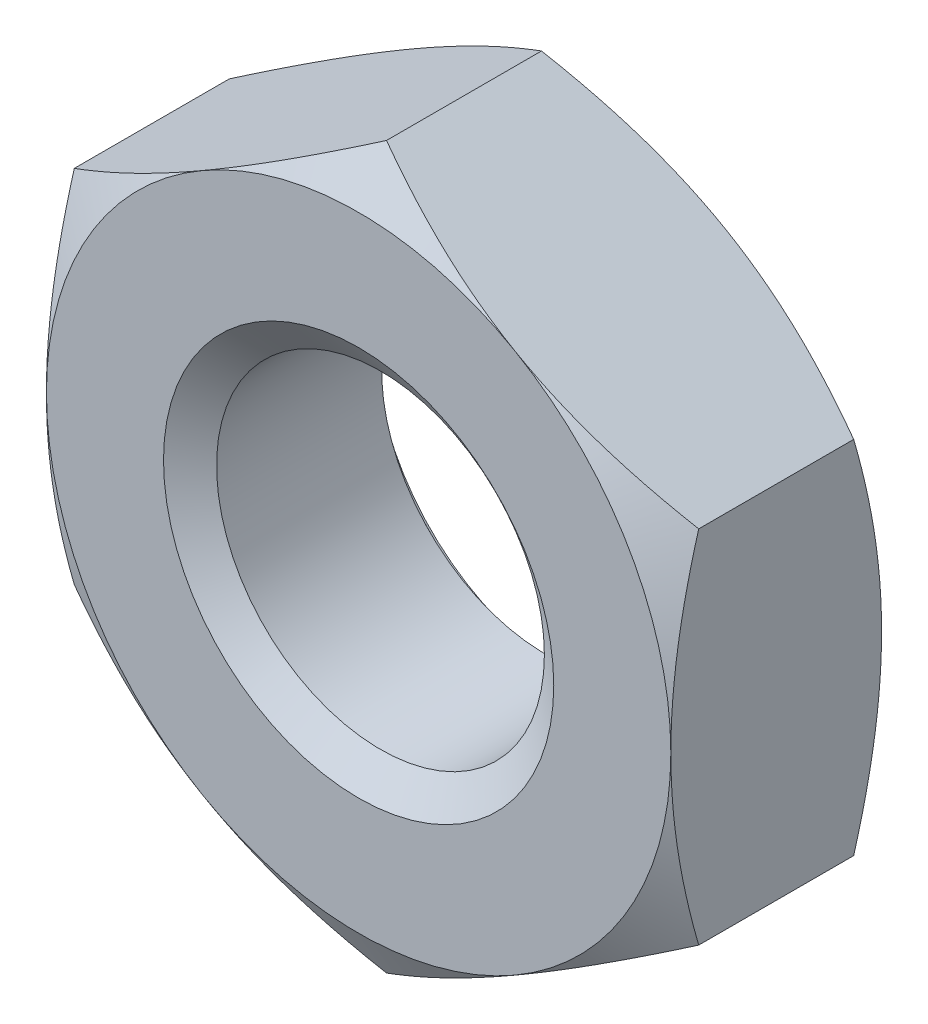
ISO-10303-21;
HEADER;
FILE_DESCRIPTION(('STEP AP214'),'2;1');
FILE_NAME('part.step','',(''),(''),'','','');
FILE_SCHEMA(('AUTOMOTIVE_DESIGN { 1 0 10303 214 1 1 1 1 }'));
ENDSEC;
DATA;
#1=APPLICATION_CONTEXT('core data for automotive mechanical design processes');
#2=APPLICATION_PROTOCOL_DEFINITION('international standard','automotive_design',2000,#1);
#3=PRODUCT_CONTEXT('',#1,'mechanical');
#4=PRODUCT('Part','Part','',(#3));
#5=PRODUCT_RELATED_PRODUCT_CATEGORY('part','',(#4));
#6=PRODUCT_DEFINITION_FORMATION('','',#4);
#7=PRODUCT_DEFINITION_CONTEXT('part definition',#1,'design');
#8=PRODUCT_DEFINITION('design','',#6,#7);
#9=PRODUCT_DEFINITION_SHAPE('','',#8);
#10=(LENGTH_UNIT() NAMED_UNIT(*) SI_UNIT(.MILLI.,.METRE.));
#11=(NAMED_UNIT(*) PLANE_ANGLE_UNIT() SI_UNIT($,.RADIAN.));
#12=(NAMED_UNIT(*) SI_UNIT($,.STERADIAN.) SOLID_ANGLE_UNIT());
#13=UNCERTAINTY_MEASURE_WITH_UNIT(LENGTH_MEASURE(1.E-05),#10,'distance_accuracy_value','');
#14=(GEOMETRIC_REPRESENTATION_CONTEXT(3) GLOBAL_UNCERTAINTY_ASSIGNED_CONTEXT((#13)) GLOBAL_UNIT_ASSIGNED_CONTEXT((#10,
#11,#12)) REPRESENTATION_CONTEXT('',''));
#15=CARTESIAN_POINT('',(0.,0.,0.));
#16=DIRECTION('',(0.,0.,1.));
#17=DIRECTION('',(1.,0.,0.));
#18=AXIS2_PLACEMENT_3D('',#15,#16,#17);
#19=CARTESIAN_POINT('',(0.,0.,-2.7));
#20=DIRECTION('',(0.,0.,1.));
#21=DIRECTION('',(1.,0.,0.));
#22=AXIS2_PLACEMENT_3D('',#19,#20,#21);
#23=CYLINDRICAL_SURFACE('',#22,2.1);
#24=CARTESIAN_POINT('',(0.,0.,-0.280083015283874));
#25=DIRECTION('',(0.,0.,1.));
#26=DIRECTION('',(1.,0.,0.));
#27=AXIS2_PLACEMENT_3D('',#24,#25,#26);
#28=CIRCLE('',#27,2.1);
#29=CARTESIAN_POINT('',(2.1,0.,-0.280083015283874));
#30=VERTEX_POINT('',#29);
#31=EDGE_CURVE('E174',#30,#30,#28,.F.);
#32=CARTESIAN_POINT('',(0.,0.,-2.39451698471611));
#33=DIRECTION('',(0.,0.,-1.));
#34=DIRECTION('',(-1.,0.,0.));
#35=AXIS2_PLACEMENT_3D('',#32,#33,#34);
#36=CIRCLE('',#35,2.1);
#37=CARTESIAN_POINT('',(2.1,0.,-2.39451698471611));
#38=VERTEX_POINT('',#37);
#39=EDGE_CURVE('E39',#38,#38,#36,.F.);
#40=CARTESIAN_POINT('',(2.1,0.,-0.280083015283874));
#41=CARTESIAN_POINT('',(2.1,0.,-0.302108369132126));
#42=CARTESIAN_POINT('',(2.1,0.,-0.324133722980379));
#43=CARTESIAN_POINT('',(2.1,0.,-0.368184430676884));
#44=CARTESIAN_POINT('',(2.1,0.,-0.390209784525137));
#45=CARTESIAN_POINT('',(2.1,0.,-0.434260492221642));
#46=CARTESIAN_POINT('',(2.1,0.,-0.456285846069894));
#47=CARTESIAN_POINT('',(2.1,0.,-0.500336553766399));
#48=CARTESIAN_POINT('',(2.1,0.,-0.522361907614652));
#49=CARTESIAN_POINT('',(2.1,0.,-0.566412615311157));
#50=CARTESIAN_POINT('',(2.1,0.,-0.588437969159409));
#51=CARTESIAN_POINT('',(2.1,0.,-0.632488676855914));
#52=CARTESIAN_POINT('',(2.1,0.,-0.654514030704167));
#53=CARTESIAN_POINT('',(2.1,0.,-0.698564738400672));
#54=CARTESIAN_POINT('',(2.1,0.,-0.720590092248924));
#55=CARTESIAN_POINT('',(2.1,0.,-0.764640799945429));
#56=CARTESIAN_POINT('',(2.1,0.,-0.786666153793681));
#57=CARTESIAN_POINT('',(2.1,0.,-0.830716861490186));
#58=CARTESIAN_POINT('',(2.1,0.,-0.852742215338439));
#59=CARTESIAN_POINT('',(2.1,0.,-0.896792923034944));
#60=CARTESIAN_POINT('',(2.1,0.,-0.918818276883196));
#61=CARTESIAN_POINT('',(2.1,0.,-0.962868984579701));
#62=CARTESIAN_POINT('',(2.1,0.,-0.984894338427954));
#63=CARTESIAN_POINT('',(2.1,0.,-1.02894504612446));
#64=CARTESIAN_POINT('',(2.1,0.,-1.05097039997271));
#65=CARTESIAN_POINT('',(2.1,0.,-1.09502110766922));
#66=CARTESIAN_POINT('',(2.1,0.,-1.11704646151747));
#67=CARTESIAN_POINT('',(2.1,0.,-1.16109716921397));
#68=CARTESIAN_POINT('',(2.1,0.,-1.18312252306223));
#69=CARTESIAN_POINT('',(2.1,0.,-1.22717323075873));
#70=CARTESIAN_POINT('',(2.1,0.,-1.24919858460698));
#71=CARTESIAN_POINT('',(2.1,0.,-1.29324929230349));
#72=CARTESIAN_POINT('',(2.1,0.,-1.31527464615174));
#73=CARTESIAN_POINT('',(2.1,0.,-1.35932535384825));
#74=CARTESIAN_POINT('',(2.1,0.,-1.3813507076965));
#75=CARTESIAN_POINT('',(2.1,0.,-1.425401415393));
#76=CARTESIAN_POINT('',(2.1,0.,-1.44742676924126));
#77=CARTESIAN_POINT('',(2.1,0.,-1.49147747693776));
#78=CARTESIAN_POINT('',(2.1,0.,-1.51350283078601));
#79=CARTESIAN_POINT('',(2.1,0.,-1.55755353848252));
#80=CARTESIAN_POINT('',(2.1,0.,-1.57957889233077));
#81=CARTESIAN_POINT('',(2.1,0.,-1.62362960002728));
#82=CARTESIAN_POINT('',(2.1,0.,-1.64565495387553));
#83=CARTESIAN_POINT('',(2.1,0.,-1.68970566157203));
#84=CARTESIAN_POINT('',(2.1,0.,-1.71173101542029));
#85=CARTESIAN_POINT('',(2.1,0.,-1.75578172311679));
#86=CARTESIAN_POINT('',(2.1,0.,-1.77780707696504));
#87=CARTESIAN_POINT('',(2.1,0.,-1.82185778466155));
#88=CARTESIAN_POINT('',(2.1,0.,-1.8438831385098));
#89=CARTESIAN_POINT('',(2.1,0.,-1.88793384620631));
#90=CARTESIAN_POINT('',(2.1,0.,-1.90995920005456));
#91=CARTESIAN_POINT('',(2.1,0.,-1.95400990775106));
#92=CARTESIAN_POINT('',(2.1,0.,-1.97603526159932));
#93=CARTESIAN_POINT('',(2.1,0.,-2.02008596929582));
#94=CARTESIAN_POINT('',(2.1,0.,-2.04211132314407));
#95=CARTESIAN_POINT('',(2.1,0.,-2.08616203084058));
#96=CARTESIAN_POINT('',(2.1,0.,-2.10818738468883));
#97=CARTESIAN_POINT('',(2.1,0.,-2.15223809238534));
#98=CARTESIAN_POINT('',(2.1,0.,-2.17426344623359));
#99=CARTESIAN_POINT('',(2.1,0.,-2.21831415393009));
#100=CARTESIAN_POINT('',(2.1,0.,-2.24033950777835));
#101=CARTESIAN_POINT('',(2.1,0.,-2.28439021547485));
#102=CARTESIAN_POINT('',(2.1,0.,-2.3064155693231));
#103=CARTESIAN_POINT('',(2.1,0.,-2.35046627701961));
#104=CARTESIAN_POINT('',(2.1,0.,-2.37249163086786));
#105=CARTESIAN_POINT('',(2.1,0.,-2.39451698471611));
#106=B_SPLINE_CURVE_WITH_KNOTS('',3,(#40,#41,#42,#43,#44,#45,#46,#47,#48,#49,#50,#51,#52,#53,
#54,#55,#56,#57,#58,#59,#60,#61,#62,#63,#64,#65,#66,#67,#68,#69,#70,#71,#72,#73,#74,#75,#76,#77,
#78,#79,#80,#81,#82,#83,#84,#85,#86,#87,#88,#89,#90,#91,#92,#93,#94,#95,#96,#97,#98,#99,#100,
#101,#102,#103,#104,#105),.UNSPECIFIED.,.F.,.F.,(4,2,2,2,2,2,2,2,2,2,2,2,2,2,2,2,2,2,2,2,2,2,2,
2,2,2,2,2,2,2,2,2,4),(0.,0.0660760615447576,0.132152123089515,0.198228184634273,
0.26430424617903,0.330380307723787,0.396456369268545,0.462532430813302,0.52860849235806,
0.594684553902817,0.660760615447575,0.726836676992332,0.79291273853709,0.858988800081848,
0.925064861626605,0.991140923171362,1.05721698471612,1.12329304626088,1.18936910780564,
1.25544516935039,1.32152123089515,1.38759729243991,1.45367335398466,1.51974941552942,
1.58582547707418,1.65190153861894,1.7179776001637,1.78405366170845,1.85012972325321,
1.91620578479797,1.98228184634272,2.04835790788748,2.11443396943224),.UNSPECIFIED.);
#107=EDGE_CURVE('BSEAM34',#30,#38,#106,.T.);
#108=ORIENTED_EDGE('',*,*,#31,.F.);
#109=ORIENTED_EDGE('',*,*,#39,.F.);
#110=ORIENTED_EDGE('',*,*,#107,.T.);
#111=ORIENTED_EDGE('',*,*,#107,.F.);
#112=EDGE_LOOP('',(#108,#110,#109,#111));
#113=FACE_BOUND('',#112,.T.);
#114=ADVANCED_FACE('F34',(#113),#23,.F.);
#115=CARTESIAN_POINT('',(0.,4.61880215351703,-2.7));
#116=DIRECTION('',(-0.500000000000007,0.866025403784434,0.));
#117=DIRECTION('',(-0.866025403784435,-0.500000000000007,0.));
#118=AXIS2_PLACEMENT_3D('',#115,#116,#117);
#119=PLANE('',#118);
#120=DIRECTION('',(0.,0.,1.));
#121=VECTOR('',#120,1.);
#122=CARTESIAN_POINT('',(-4.,2.30940107675848,-2.7));
#123=LINE('',#122,#121);
#124=CARTESIAN_POINT('',(-4.,2.30940107675855,-2.34273441009182));
#125=VERTEX_POINT('',#124);
#126=CARTESIAN_POINT('',(-4.,2.30940107675848,-0.357265589908158));
#127=VERTEX_POINT('',#126);
#128=EDGE_CURVE('E164',#125,#127,#123,.T.);
#129=ORIENTED_EDGE('',*,*,#128,.T.);
#130=CARTESIAN_POINT('',(-4.0002,2.30928560670464,-0.357332259074762));
#131=CARTESIAN_POINT('',(-3.82442084967677,2.41077174646168,-0.298717873648278));
#132=CARTESIAN_POINT('',(-3.64712438367362,2.51313390883497,-0.245410321462258));
#133=CARTESIAN_POINT('',(-3.2894614068243,2.7196307247981,-0.1523616707464));
#134=CARTESIAN_POINT('',(-3.10908854102985,2.82376904741903,-0.112653489029701));
#135=CARTESIAN_POINT('',(-2.75057818129722,3.03075510011794,-0.0508422152802766));
#136=CARTESIAN_POINT('',(-2.57249584706487,3.1335709837249,-0.0283277315228868));
#137=CARTESIAN_POINT('',(-2.2154932828335,3.33968651028527,-0.00145062314658075));
#138=CARTESIAN_POINT('',(-2.03657435035591,3.44298540411433,0.00293425857305725));
#139=CARTESIAN_POINT('',(-1.70225715780328,3.63600352522932,-0.00619007293997113));
#140=CARTESIAN_POINT('',(-1.54680884001294,3.72575165335065,-0.0174589539879961));
#141=CARTESIAN_POINT('',(-1.23692494436495,3.90466320392055,-0.0531739907981968));
#142=CARTESIAN_POINT('',(-1.08249043825588,3.99382600759479,-0.0776323457115377));
#143=CARTESIAN_POINT('',(-0.771967672225425,4.17310641015198,-0.138776064919297));
#144=CARTESIAN_POINT('',(-0.615918711936899,4.26320131938133,-0.175720603654872));
#145=CARTESIAN_POINT('',(-0.306148164596159,4.44204742827552,-0.259570072548039));
#146=CARTESIAN_POINT('',(-0.152422609226218,4.53080091904968,-0.306455302212754));
#147=CARTESIAN_POINT('',(0.000200000000004147,4.61891762357087,-0.357332259074783));
#148=B_SPLINE_CURVE_WITH_KNOTS('',3,(#130,#131,#132,#133,#134,#135,#136,#137,#138,#139,#140,
#141,#142,#143,#144,#145,#146,#147),.UNSPECIFIED.,.F.,.F.,(4,2,2,2,2,2,2,2,4),(0.,
0.634047835695964,1.26961969224543,1.88946157213122,2.50854226669297,3.04757825393386,
3.58711366126905,4.13861653143766,4.68903648037746),.UNSPECIFIED.);
#149=CARTESIAN_POINT('',(-2.00000000000003,3.46410161513774,0.));
#150=VERTEX_POINT('',#149);
#151=EDGE_CURVE('E133',#127,#150,#148,.T.);
#152=ORIENTED_EDGE('',*,*,#151,.T.);
#153=CARTESIAN_POINT('',(0.,4.61880215351703,-0.357265589908179));
#154=VERTEX_POINT('',#153);
#155=EDGE_CURVE('E53',#150,#154,#148,.T.);
#156=ORIENTED_EDGE('',*,*,#155,.T.);
#157=DIRECTION('',(0.,0.,1.));
#158=VECTOR('',#157,1.);
#159=CARTESIAN_POINT('',(0.,4.61880215351703,-2.7));
#160=LINE('',#159,#158);
#161=CARTESIAN_POINT('',(0.,4.61880215351703,-2.34273441009182));
#162=VERTEX_POINT('',#161);
#163=EDGE_CURVE('E149',#162,#154,#160,.T.);
#164=ORIENTED_EDGE('',*,*,#163,.F.);
#165=CARTESIAN_POINT('',(-4.0002,2.30928560670464,-2.34266774092524));
#166=CARTESIAN_POINT('',(-3.82442084967677,2.41077174646168,-2.40128212635172));
#167=CARTESIAN_POINT('',(-3.64712438367362,2.51313390883497,-2.45458967853774));
#168=CARTESIAN_POINT('',(-3.2894614068243,2.7196307247981,-2.5476383292536));
#169=CARTESIAN_POINT('',(-3.10908854102985,2.82376904741903,-2.5873465109703));
#170=CARTESIAN_POINT('',(-2.75057818129722,3.03075510011794,-2.64915778471972));
#171=CARTESIAN_POINT('',(-2.57249584706487,3.1335709837249,-2.67167226847711));
#172=CARTESIAN_POINT('',(-2.2154932828335,3.33968651028527,-2.69854937685342));
#173=CARTESIAN_POINT('',(-2.03657435035591,3.44298540411433,-2.70293425857306));
#174=CARTESIAN_POINT('',(-1.70225715780328,3.63600352522932,-2.69380992706003));
#175=CARTESIAN_POINT('',(-1.54680884001294,3.72575165335065,-2.682541046012));
#176=CARTESIAN_POINT('',(-1.23692494436495,3.90466320392055,-2.6468260092018));
#177=CARTESIAN_POINT('',(-1.08249043825588,3.99382600759479,-2.62236765428846));
#178=CARTESIAN_POINT('',(-0.771967672225424,4.17310641015198,-2.5612239350807));
#179=CARTESIAN_POINT('',(-0.615918711936899,4.26320131938133,-2.52427939634513));
#180=CARTESIAN_POINT('',(-0.306148164596159,4.44204742827552,-2.44042992745196));
#181=CARTESIAN_POINT('',(-0.152422609226218,4.53080091904969,-2.39354469778725));
#182=CARTESIAN_POINT('',(0.000200000000004149,4.61891762357087,-2.34266774092522));
#183=B_SPLINE_CURVE_WITH_KNOTS('',3,(#165,#166,#167,#168,#169,#170,#171,#172,#173,#174,#175,
#176,#177,#178,#179,#180,#181,#182),.UNSPECIFIED.,.F.,.F.,(4,2,2,2,2,2,2,2,4),(0.,
0.634047835695964,1.26961969224543,1.88946157213122,2.50854226669297,3.04757825393386,
3.58711366126905,4.13861653143766,4.68903648037746),.UNSPECIFIED.);
#184=CARTESIAN_POINT('',(-2.00000000000003,3.46410161513774,-2.7));
#185=VERTEX_POINT('',#184);
#186=EDGE_CURVE('E167',#185,#162,#183,.T.);
#187=ORIENTED_EDGE('',*,*,#186,.F.);
#188=EDGE_CURVE('E266',#125,#185,#183,.T.);
#189=ORIENTED_EDGE('',*,*,#188,.F.);
#190=EDGE_LOOP('',(#129,#152,#156,#164,#187,#189));
#191=FACE_BOUND('',#190,.T.);
#192=ADVANCED_FACE('F36',(#191),#119,.T.);
#193=CARTESIAN_POINT('',(4.,2.30940107675847,-2.7));
#194=DIRECTION('',(0.500000000000009,0.866025403784433,0.));
#195=DIRECTION('',(-0.866025403784433,0.500000000000009,0.));
#196=AXIS2_PLACEMENT_3D('',#193,#194,#195);
#197=PLANE('',#196);
#198=ORIENTED_EDGE('',*,*,#163,.T.);
#199=CARTESIAN_POINT('',(-0.000199999999995798,4.61891762357087,-0.357332259074783));
#200=CARTESIAN_POINT('',(0.175579150323232,4.51743148381383,-0.298717873648296));
#201=CARTESIAN_POINT('',(0.352875616326384,4.41506932144053,-0.245410321462275));
#202=CARTESIAN_POINT('',(0.71053859317571,4.20857250547741,-0.152361670746413));
#203=CARTESIAN_POINT('',(0.890911458970154,4.10443418285648,-0.112653489029712));
#204=CARTESIAN_POINT('',(1.24942181870279,3.89744813015757,-0.0508422152802835));
#205=CARTESIAN_POINT('',(1.42750415293515,3.7946322465506,-0.0283277315228917));
#206=CARTESIAN_POINT('',(1.78450671716651,3.58851671999023,-0.00145062314658183));
#207=CARTESIAN_POINT('',(1.9634256496441,3.48521782616117,0.00293425857305806));
#208=CARTESIAN_POINT('',(2.29774284219673,3.29219970504618,-0.00619007293996718));
#209=CARTESIAN_POINT('',(2.45319115998707,3.20245157692485,-0.0174589539879905));
#210=CARTESIAN_POINT('',(2.76307505563506,3.02354002635495,-0.0531739907981881));
#211=CARTESIAN_POINT('',(2.91750956174413,2.93437722268071,-0.0776323457115274));
#212=CARTESIAN_POINT('',(3.22803232777458,2.75509682012352,-0.138776064919283));
#213=CARTESIAN_POINT('',(3.3840812880631,2.66500191089418,-0.175720603654856));
#214=CARTESIAN_POINT('',(3.69385183540384,2.48615580199998,-0.25957007254802));
#215=CARTESIAN_POINT('',(3.84757739077378,2.39740231122582,-0.306455302212732));
#216=CARTESIAN_POINT('',(4.0002,2.30928560670464,-0.35733225907476));
#217=B_SPLINE_CURVE_WITH_KNOTS('',3,(#199,#200,#201,#202,#203,#204,#205,#206,#207,#208,#209,
#210,#211,#212,#213,#214,#215,#216),.UNSPECIFIED.,.F.,.F.,(4,2,2,2,2,2,2,2,4),(0.,
0.63404783569597,1.26961969224544,1.88946157213123,2.50854226669299,3.04757825393387,
3.58711366126905,4.13861653143766,4.68903648037746),.UNSPECIFIED.);
#218=CARTESIAN_POINT('',(2.00000000000004,3.46410161513773,0.));
#219=VERTEX_POINT('',#218);
#220=EDGE_CURVE('E143',#154,#219,#217,.T.);
#221=ORIENTED_EDGE('',*,*,#220,.T.);
#222=CARTESIAN_POINT('',(4.,2.30940107675855,-0.357265589908179));
#223=VERTEX_POINT('',#222);
#224=EDGE_CURVE('E60',#219,#223,#217,.T.);
#225=ORIENTED_EDGE('',*,*,#224,.T.);
#226=DIRECTION('',(0.,0.,1.));
#227=VECTOR('',#226,1.);
#228=CARTESIAN_POINT('',(4.,2.30940107675847,-2.7));
#229=LINE('',#228,#227);
#230=CARTESIAN_POINT('',(4.,2.30940107675855,-2.34273441009182));
#231=VERTEX_POINT('',#230);
#232=EDGE_CURVE('E142',#231,#223,#229,.T.);
#233=ORIENTED_EDGE('',*,*,#232,.F.);
#234=CARTESIAN_POINT('',(-0.000199999999996007,4.61891762357087,-2.34266774092522));
#235=CARTESIAN_POINT('',(0.175579150323232,4.51743148381383,-2.4012821263517));
#236=CARTESIAN_POINT('',(0.352875616326384,4.41506932144053,-2.45458967853773));
#237=CARTESIAN_POINT('',(0.71053859317571,4.20857250547741,-2.54763832925359));
#238=CARTESIAN_POINT('',(0.890911458970154,4.10443418285648,-2.58734651097029));
#239=CARTESIAN_POINT('',(1.24942181870279,3.89744813015757,-2.64915778471972));
#240=CARTESIAN_POINT('',(1.42750415293514,3.7946322465506,-2.67167226847711));
#241=CARTESIAN_POINT('',(1.78450671716651,3.58851671999023,-2.69854937685342));
#242=CARTESIAN_POINT('',(1.9634256496441,3.48521782616117,-2.70293425857306));
#243=CARTESIAN_POINT('',(2.29774284219673,3.29219970504618,-2.69380992706003));
#244=CARTESIAN_POINT('',(2.45319115998707,3.20245157692485,-2.68254104601201));
#245=CARTESIAN_POINT('',(2.76307505563506,3.02354002635495,-2.64682600920181));
#246=CARTESIAN_POINT('',(2.91750956174413,2.93437722268071,-2.62236765428847));
#247=CARTESIAN_POINT('',(3.22803232777458,2.75509682012352,-2.56122393508072));
#248=CARTESIAN_POINT('',(3.3840812880631,2.66500191089418,-2.52427939634514));
#249=CARTESIAN_POINT('',(3.69385183540384,2.48615580199998,-2.44042992745198));
#250=CARTESIAN_POINT('',(3.84757739077378,2.39740231122582,-2.39354469778727));
#251=CARTESIAN_POINT('',(4.0002,2.30928560670464,-2.34266774092524));
#252=B_SPLINE_CURVE_WITH_KNOTS('',3,(#234,#235,#236,#237,#238,#239,#240,#241,#242,#243,#244,
#245,#246,#247,#248,#249,#250,#251),.UNSPECIFIED.,.F.,.F.,(4,2,2,2,2,2,2,2,4),(0.,
0.63404783569597,1.26961969224544,1.88946157213123,2.50854226669299,3.04757825393387,
3.58711366126905,4.13861653143766,4.68903648037746),.UNSPECIFIED.);
#253=CARTESIAN_POINT('',(2.00000000000004,3.46410161513773,-2.7));
#254=VERTEX_POINT('',#253);
#255=EDGE_CURVE('E259',#254,#231,#252,.T.);
#256=ORIENTED_EDGE('',*,*,#255,.F.);
#257=EDGE_CURVE('E265',#162,#254,#252,.T.);
#258=ORIENTED_EDGE('',*,*,#257,.F.);
#259=EDGE_LOOP('',(#198,#221,#225,#233,#256,#258));
#260=FACE_BOUND('',#259,.T.);
#261=ADVANCED_FACE('F140',(#260),#197,.T.);
#262=CARTESIAN_POINT('',(4.,2.30940107675847,-2.7));
#263=DIRECTION('',(-1.,0.,0.));
#264=DIRECTION('',(0.,0.,1.));
#265=AXIS2_PLACEMENT_3D('',#262,#263,#264);
#266=PLANE('',#265);
#267=CARTESIAN_POINT('',(4.,-6.12487198995898,-1.91410682124067));
#268=CARTESIAN_POINT('',(4.,-5.94924937038682,-1.82923627076693));
#269=CARTESIAN_POINT('',(4.,-5.77321152095291,-1.74520940380742));
#270=CARTESIAN_POINT('',(4.,-5.4200808477796,-1.57932514679719));
#271=CARTESIAN_POINT('',(4.,-5.24298784779933,-1.49746813236726));
#272=CARTESIAN_POINT('',(4.,-4.88656571686339,-1.33597446305858));
#273=CARTESIAN_POINT('',(4.,-4.70722958889367,-1.25635319506306));
#274=CARTESIAN_POINT('',(4.,-4.34708334747268,-1.10053058542032));
#275=CARTESIAN_POINT('',(4.,-4.16627331143542,-1.02432906550804));
#276=CARTESIAN_POINT('',(4.,-3.80064706744982,-0.875350650394381));
#277=CARTESIAN_POINT('',(4.,-3.61580892822774,-0.802627284215864));
#278=CARTESIAN_POINT('',(4.,-3.24395246794973,-0.662876230959437));
#279=CARTESIAN_POINT('',(4.,-3.05693390695806,-0.595849177566521));
#280=CARTESIAN_POINT('',(4.,-2.68080318253775,-0.469291748430897));
#281=CARTESIAN_POINT('',(4.,-2.49169643712853,-0.409745434783851));
#282=CARTESIAN_POINT('',(4.,-2.11079454635856,-0.300083356544519));
#283=CARTESIAN_POINT('',(4.,-1.91900027185753,-0.249964609676763));
#284=CARTESIAN_POINT('',(4.,-1.53259232698204,-0.161590794954051));
#285=CARTESIAN_POINT('',(4.,-1.33797792031654,-0.123338885956548));
#286=CARTESIAN_POINT('',(4.,-0.946402725872595,-0.0612742359223491));
#287=CARTESIAN_POINT('',(4.,-0.749441936019814,-0.0374615076517036));
#288=CARTESIAN_POINT('',(4.,-0.355451989627982,-0.00638181314943841));
#289=CARTESIAN_POINT('',(4.,-0.15843131109405,0.000989900761040625));
#290=CARTESIAN_POINT('',(4.,0.235472085607432,-0.00120406637479415));
#291=CARTESIAN_POINT('',(4.,0.432354826312169,-0.0107653508153485));
#292=CARTESIAN_POINT('',(4.,0.768560635225481,-0.0408787346135872));
#293=CARTESIAN_POINT('',(4.,0.908254618381783,-0.0575092960439057));
#294=CARTESIAN_POINT('',(4.,1.18656349063493,-0.0982134103466861));
#295=CARTESIAN_POINT('',(4.,1.32517820601009,-0.12228813705844));
#296=CARTESIAN_POINT('',(4.,1.73929045452965,-0.204415070950222));
#297=CARTESIAN_POINT('',(4.,2.01284690528718,-0.272348886425143));
#298=CARTESIAN_POINT('',(4.,2.42218253014519,-0.389516359317191));
#299=CARTESIAN_POINT('',(4.,2.56009536361534,-0.431713941811623));
#300=CARTESIAN_POINT('',(4.,2.83448159101399,-0.520284580227747));
#301=CARTESIAN_POINT('',(4.,2.97095590623552,-0.566654756186896));
#302=CARTESIAN_POINT('',(4.,3.24189440516335,-0.662605699180268));
#303=CARTESIAN_POINT('',(4.,3.37636557946833,-0.712166925753481));
#304=CARTESIAN_POINT('',(4.,3.64426461152908,-0.814198353790681));
#305=CARTESIAN_POINT('',(4.,3.77769202239381,-0.866669730963348));
#306=CARTESIAN_POINT('',(4.,3.91063698986678,-0.920309006541771));
#307=B_SPLINE_CURVE_WITH_KNOTS('',3,(#267,#268,#269,#270,#271,#272,#273,#274,#275,#276,#277,
#278,#279,#280,#281,#282,#283,#284,#285,#286,#287,#288,#289,#290,#291,#292,#293,#294,#295,#296,
#297,#298,#299,#300,#301,#302,#303,#304,#305,#306),.UNSPECIFIED.,.F.,.F.,(4,2,2,2,2,2,2,2,2,2,2,
2,2,2,2,2,2,2,2,4),(0.,0.585171792532274,1.17044423059927,1.7590659464599,2.34765694284828,
2.94347400997485,3.5393572721069,4.13394864697602,4.72835161391473,5.32291267067847,
5.91747425310815,6.50823685854039,7.09884609659889,7.52068140825524,7.94258327130842,
8.78701491359831,9.21965281897691,9.65199437116298,10.0819024146297,10.5119854255247),.UNSPECIFIED.);
#308=CARTESIAN_POINT('',(4.,-2.30940107675855,-0.357265589908179));
#309=VERTEX_POINT('',#308);
#310=CARTESIAN_POINT('',(4.,0.,0.));
#311=VERTEX_POINT('',#310);
#312=EDGE_CURVE('E135',#309,#311,#307,.T.);
#313=ORIENTED_EDGE('',*,*,#312,.F.);
#314=DIRECTION('',(0.,0.,1.));
#315=VECTOR('',#314,1.);
#316=CARTESIAN_POINT('',(4.,-2.30940107675855,-2.7));
#317=LINE('',#316,#315);
#318=CARTESIAN_POINT('',(4.,-2.30940107675855,-2.34273441009182));
#319=VERTEX_POINT('',#318);
#320=EDGE_CURVE('E150',#319,#309,#317,.T.);
#321=ORIENTED_EDGE('',*,*,#320,.F.);
#322=CARTESIAN_POINT('',(4.,-6.12487198995897,-0.785893178759334));
#323=CARTESIAN_POINT('',(4.,-5.94924937038682,-0.870763729233076));
#324=CARTESIAN_POINT('',(4.,-5.77321152095291,-0.954790596192577));
#325=CARTESIAN_POINT('',(4.,-5.4200808477796,-1.12067485320281));
#326=CARTESIAN_POINT('',(4.,-5.24298784779933,-1.20253186763274));
#327=CARTESIAN_POINT('',(4.,-4.88656571686339,-1.36402553694142));
#328=CARTESIAN_POINT('',(4.,-4.70722958889367,-1.44364680493694));
#329=CARTESIAN_POINT('',(4.,-4.34708334747268,-1.59946941457968));
#330=CARTESIAN_POINT('',(4.,-4.16627331143542,-1.67567093449196));
#331=CARTESIAN_POINT('',(4.,-3.80064706744982,-1.82464934960562));
#332=CARTESIAN_POINT('',(4.,-3.61580892822775,-1.89737271578414));
#333=CARTESIAN_POINT('',(4.,-3.24395246794973,-2.03712376904056));
#334=CARTESIAN_POINT('',(4.,-3.05693390695806,-2.10415082243348));
#335=CARTESIAN_POINT('',(4.,-2.68080318253775,-2.2307082515691));
#336=CARTESIAN_POINT('',(4.,-2.49169643712853,-2.29025456521615));
#337=CARTESIAN_POINT('',(4.,-2.11079454635856,-2.39991664345548));
#338=CARTESIAN_POINT('',(4.,-1.91900027185753,-2.45003539032324));
#339=CARTESIAN_POINT('',(4.,-1.53259232698204,-2.53840920504595));
#340=CARTESIAN_POINT('',(4.,-1.33797792031654,-2.57666111404345));
#341=CARTESIAN_POINT('',(4.,-0.946402725872595,-2.63872576407765));
#342=CARTESIAN_POINT('',(4.,-0.749441936019815,-2.6625384923483));
#343=CARTESIAN_POINT('',(4.,-0.355451989627982,-2.69361818685056));
#344=CARTESIAN_POINT('',(4.,-0.15843131109405,-2.70098990076104));
#345=CARTESIAN_POINT('',(4.,0.235472085607431,-2.69879593362521));
#346=CARTESIAN_POINT('',(4.,0.432354826312169,-2.68923464918465));
#347=CARTESIAN_POINT('',(4.,0.76856063522548,-2.65912126538641));
#348=CARTESIAN_POINT('',(4.,0.908254618381782,-2.6424907039561));
#349=CARTESIAN_POINT('',(4.,1.18656349063493,-2.60178658965331));
#350=CARTESIAN_POINT('',(4.,1.32517820601009,-2.57771186294156));
#351=CARTESIAN_POINT('',(4.,1.73929045452965,-2.49558492904978));
#352=CARTESIAN_POINT('',(4.,2.01284690528718,-2.42765111357486));
#353=CARTESIAN_POINT('',(4.,2.42218253014519,-2.31048364068281));
#354=CARTESIAN_POINT('',(4.,2.56009536361534,-2.26828605818838));
#355=CARTESIAN_POINT('',(4.,2.83448159101399,-2.17971541977225));
#356=CARTESIAN_POINT('',(4.,2.97095590623552,-2.13334524381311));
#357=CARTESIAN_POINT('',(4.,3.24189440516335,-2.03739430081973));
#358=CARTESIAN_POINT('',(4.,3.37636557946833,-1.98783307424652));
#359=CARTESIAN_POINT('',(4.,3.64426461152908,-1.88580164620932));
#360=CARTESIAN_POINT('',(4.,3.77769202239381,-1.83333026903665));
#361=CARTESIAN_POINT('',(4.,3.91063698986678,-1.77969099345823));
#362=B_SPLINE_CURVE_WITH_KNOTS('',3,(#322,#323,#324,#325,#326,#327,#328,#329,#330,#331,#332,
#333,#334,#335,#336,#337,#338,#339,#340,#341,#342,#343,#344,#345,#346,#347,#348,#349,#350,#351,
#352,#353,#354,#355,#356,#357,#358,#359,#360,#361),.UNSPECIFIED.,.F.,.F.,(4,2,2,2,2,2,2,2,2,2,2,
2,2,2,2,2,2,2,2,4),(0.,0.585171792532274,1.17044423059927,1.7590659464599,2.34765694284828,
2.94347400997484,3.5393572721069,4.13394864697602,4.72835161391473,5.32291267067847,
5.91747425310815,6.50823685854039,7.09884609659889,7.52068140825523,7.94258327130841,
8.78701491359831,9.2196528189769,9.65199437116298,10.0819024146297,10.5119854255247),.UNSPECIFIED.);
#363=CARTESIAN_POINT('',(4.,0.,-2.7));
#364=VERTEX_POINT('',#363);
#365=EDGE_CURVE('E273',#319,#364,#362,.T.);
#366=ORIENTED_EDGE('',*,*,#365,.T.);
#367=EDGE_CURVE('E148',#364,#231,#362,.T.);
#368=ORIENTED_EDGE('',*,*,#367,.T.);
#369=ORIENTED_EDGE('',*,*,#232,.T.);
#370=EDGE_CURVE('E125',#311,#223,#307,.T.);
#371=ORIENTED_EDGE('',*,*,#370,.F.);
#372=EDGE_LOOP('',(#313,#321,#366,#368,#369,#371));
#373=FACE_BOUND('',#372,.T.);
#374=ADVANCED_FACE('F146',(#373),#266,.F.);
#375=CARTESIAN_POINT('',(0.,-4.6188021535171,-2.7));
#376=DIRECTION('',(0.500000000000006,-0.866025403784435,0.));
#377=DIRECTION('',(0.866025403784435,0.500000000000006,0.));
#378=AXIS2_PLACEMENT_3D('',#375,#376,#377);
#379=PLANE('',#378);
#380=ORIENTED_EDGE('',*,*,#320,.T.);
#381=CARTESIAN_POINT('',(4.0002,-2.30928560670472,-0.357332259074783));
#382=CARTESIAN_POINT('',(3.82442084967677,-2.41077174646176,-0.2987178736483));
#383=CARTESIAN_POINT('',(3.64712438367362,-2.51313390883505,-0.245410321462281));
#384=CARTESIAN_POINT('',(3.28946140682429,-2.71963072479817,-0.152361670746424));
#385=CARTESIAN_POINT('',(3.10908854102984,-2.8237690474191,-0.112653489029727));
#386=CARTESIAN_POINT('',(2.7505781812972,-3.03075510011802,-0.050842215280305));
#387=CARTESIAN_POINT('',(2.57249584706485,-3.13357098372498,-0.0283277315229168));
#388=CARTESIAN_POINT('',(2.21549328283348,-3.33968651028535,-0.00145062314661381));
#389=CARTESIAN_POINT('',(2.03657435035589,-3.44298540411441,0.0029342585730228));
#390=CARTESIAN_POINT('',(1.70225715780326,-3.6360035252294,-0.00619007294000837));
#391=CARTESIAN_POINT('',(1.54680884001293,-3.72575165335072,-0.0174589539880344));
#392=CARTESIAN_POINT('',(1.23692494436494,-3.90466320392062,-0.0531739907982368));
#393=CARTESIAN_POINT('',(1.08249043825586,-3.99382600759487,-0.0776323457115782));
#394=CARTESIAN_POINT('',(0.771967672225418,-4.17310641015206,-0.138776064919337));
#395=CARTESIAN_POINT('',(0.615918711936894,-4.2632013193814,-0.175720603654912));
#396=CARTESIAN_POINT('',(0.306148164596158,-4.44204742827559,-0.259570072548078));
#397=CARTESIAN_POINT('',(0.152422609226219,-4.53080091904975,-0.306455302212793));
#398=CARTESIAN_POINT('',(-0.000200000000001058,-4.61891762357094,-0.357332259074821));
#399=B_SPLINE_CURVE_WITH_KNOTS('',3,(#381,#382,#383,#384,#385,#386,#387,#388,#389,#390,#391,
#392,#393,#394,#395,#396,#397,#398),.UNSPECIFIED.,.F.,.F.,(4,2,2,2,2,2,2,2,4),(0.,
0.634047835695971,1.26961969224544,1.88946157213123,2.50854226669299,3.04757825393388,
3.58711366126905,4.13861653143766,4.68903648037745),.UNSPECIFIED.);
#400=CARTESIAN_POINT('',(2.00000000000003,-3.46410161513774,0.));
#401=VERTEX_POINT('',#400);
#402=EDGE_CURVE('E371',#309,#401,#399,.T.);
#403=ORIENTED_EDGE('',*,*,#402,.T.);
#404=CARTESIAN_POINT('',(-1.17093834628434E-13,-4.61880215351703,-0.357265589908179));
#405=VERTEX_POINT('',#404);
#406=EDGE_CURVE('E227',#401,#405,#399,.T.);
#407=ORIENTED_EDGE('',*,*,#406,.T.);
#408=DIRECTION('',(0.,0.,1.));
#409=VECTOR('',#408,1.);
#410=CARTESIAN_POINT('',(0.,-4.6188021535171,-2.7));
#411=LINE('',#410,#409);
#412=CARTESIAN_POINT('',(-1.17093834628434E-13,-4.61880215351703,-2.34273441009182));
#413=VERTEX_POINT('',#412);
#414=EDGE_CURVE('E155',#413,#405,#411,.T.);
#415=ORIENTED_EDGE('',*,*,#414,.F.);
#416=CARTESIAN_POINT('',(4.0002,-2.30928560670472,-2.34266774092522));
#417=CARTESIAN_POINT('',(3.82442084967677,-2.41077174646176,-2.4012821263517));
#418=CARTESIAN_POINT('',(3.64712438367362,-2.51313390883505,-2.45458967853772));
#419=CARTESIAN_POINT('',(3.28946140682429,-2.71963072479817,-2.54763832925358));
#420=CARTESIAN_POINT('',(3.10908854102984,-2.8237690474191,-2.58734651097027));
#421=CARTESIAN_POINT('',(2.7505781812972,-3.03075510011802,-2.6491577847197));
#422=CARTESIAN_POINT('',(2.57249584706485,-3.13357098372498,-2.67167226847708));
#423=CARTESIAN_POINT('',(2.21549328283348,-3.33968651028535,-2.69854937685339));
#424=CARTESIAN_POINT('',(2.03657435035589,-3.44298540411441,-2.70293425857302));
#425=CARTESIAN_POINT('',(1.70225715780326,-3.6360035252294,-2.69380992705999));
#426=CARTESIAN_POINT('',(1.54680884001293,-3.72575165335072,-2.68254104601197));
#427=CARTESIAN_POINT('',(1.23692494436494,-3.90466320392062,-2.64682600920176));
#428=CARTESIAN_POINT('',(1.08249043825586,-3.99382600759487,-2.62236765428842));
#429=CARTESIAN_POINT('',(0.771967672225417,-4.17310641015205,-2.56122393508066));
#430=CARTESIAN_POINT('',(0.615918711936894,-4.2632013193814,-2.52427939634509));
#431=CARTESIAN_POINT('',(0.306148164596159,-4.44204742827559,-2.44042992745192));
#432=CARTESIAN_POINT('',(0.152422609226219,-4.53080091904975,-2.39354469778721));
#433=CARTESIAN_POINT('',(-0.000200000000000568,-4.61891762357093,-2.34266774092518));
#434=B_SPLINE_CURVE_WITH_KNOTS('',3,(#416,#417,#418,#419,#420,#421,#422,#423,#424,#425,#426,
#427,#428,#429,#430,#431,#432,#433),.UNSPECIFIED.,.F.,.F.,(4,2,2,2,2,2,2,2,4),(0.,
0.63404783569597,1.26961969224544,1.88946157213123,2.50854226669299,3.04757825393388,
3.58711366126905,4.13861653143766,4.68903648037745),.UNSPECIFIED.);
#435=CARTESIAN_POINT('',(2.00000000000003,-3.46410161513774,-2.7));
#436=VERTEX_POINT('',#435);
#437=EDGE_CURVE('E280',#436,#413,#434,.T.);
#438=ORIENTED_EDGE('',*,*,#437,.F.);
#439=EDGE_CURVE('E279',#319,#436,#434,.T.);
#440=ORIENTED_EDGE('',*,*,#439,.F.);
#441=EDGE_LOOP('',(#380,#403,#407,#415,#438,#440));
#442=FACE_BOUND('',#441,.T.);
#443=ADVANCED_FACE('F292',(#442),#379,.T.);
#444=CARTESIAN_POINT('',(-4.,-2.30940107675855,-2.7));
#445=DIRECTION('',(-0.500000000000007,-0.866025403784434,0.));
#446=DIRECTION('',(0.866025403784434,-0.500000000000008,0.));
#447=AXIS2_PLACEMENT_3D('',#444,#445,#446);
#448=PLANE('',#447);
#449=ORIENTED_EDGE('',*,*,#414,.T.);
#450=CARTESIAN_POINT('',(0.000199999999998498,-4.61891762357094,-0.357332259074821));
#451=CARTESIAN_POINT('',(-0.175579150323232,-4.51743148381389,-0.298717873648334));
#452=CARTESIAN_POINT('',(-0.352875616326387,-4.4150693214406,-0.245410321462312));
#453=CARTESIAN_POINT('',(-0.710538593175718,-4.20857250547747,-0.152361670746449));
#454=CARTESIAN_POINT('',(-0.890911458970165,-4.10443418285654,-0.112653489029747));
#455=CARTESIAN_POINT('',(-1.24942181870281,-3.89744813015762,-0.0508422152803185));
#456=CARTESIAN_POINT('',(-1.42750415293516,-3.79463224655066,-0.0283277315229268));
#457=CARTESIAN_POINT('',(-1.78450671716654,-3.58851671999028,-0.00145062314661688));
#458=CARTESIAN_POINT('',(-1.96342564964413,-3.48521782616122,0.002934258573023));
#459=CARTESIAN_POINT('',(-2.29774284219676,-3.29219970504623,-0.00619007294000211));
#460=CARTESIAN_POINT('',(-2.45319115998709,-3.20245157692491,-0.0174589539880249));
#461=CARTESIAN_POINT('',(-2.76307505563508,-3.02354002635501,-0.0531739907982213));
#462=CARTESIAN_POINT('',(-2.91750956174415,-2.93437722268077,-0.0776323457115599));
#463=CARTESIAN_POINT('',(-3.22803232777459,-2.75509682012359,-0.138776064919313));
#464=CARTESIAN_POINT('',(-3.38408128806311,-2.66500191089425,-0.175720603654885));
#465=CARTESIAN_POINT('',(-3.69385183540384,-2.48615580200005,-0.259570072548045));
#466=CARTESIAN_POINT('',(-3.84757739077378,-2.39740231122589,-0.306455302212756));
#467=CARTESIAN_POINT('',(-4.0002,-2.30928560670471,-0.357332259074781));
#468=B_SPLINE_CURVE_WITH_KNOTS('',3,(#450,#451,#452,#453,#454,#455,#456,#457,#458,#459,#460,
#461,#462,#463,#464,#465,#466,#467),.UNSPECIFIED.,.F.,.F.,(4,2,2,2,2,2,2,2,4),(0.,
0.634047835695979,1.26961969224546,1.88946157213126,2.50854226669302,3.0475782539339,
3.58711366126907,4.13861653143767,4.68903648037745),.UNSPECIFIED.);
#469=CARTESIAN_POINT('',(-2.00000000000003,-3.46410161513774,0.));
#470=VERTEX_POINT('',#469);
#471=EDGE_CURVE('E368',#405,#470,#468,.T.);
#472=ORIENTED_EDGE('',*,*,#471,.T.);
#473=CARTESIAN_POINT('',(-4.,-2.30940107675855,-0.357265589908179));
#474=VERTEX_POINT('',#473);
#475=EDGE_CURVE('E200',#470,#474,#468,.T.);
#476=ORIENTED_EDGE('',*,*,#475,.T.);
#477=DIRECTION('',(0.,0.,1.));
#478=VECTOR('',#477,1.);
#479=CARTESIAN_POINT('',(-4.,-2.30940107675855,-2.7));
#480=LINE('',#479,#478);
#481=CARTESIAN_POINT('',(-4.,-2.30940107675855,-2.34273441009182));
#482=VERTEX_POINT('',#481);
#483=EDGE_CURVE('E161',#482,#474,#480,.T.);
#484=ORIENTED_EDGE('',*,*,#483,.F.);
#485=CARTESIAN_POINT('',(0.00019999999999844,-4.61891762357094,-2.34266774092518));
#486=CARTESIAN_POINT('',(-0.175579150323232,-4.51743148381389,-2.40128212635167));
#487=CARTESIAN_POINT('',(-0.352875616326387,-4.4150693214406,-2.45458967853769));
#488=CARTESIAN_POINT('',(-0.710538593175718,-4.20857250547747,-2.54763832925355));
#489=CARTESIAN_POINT('',(-0.890911458970165,-4.10443418285654,-2.58734651097025));
#490=CARTESIAN_POINT('',(-1.24942181870281,-3.89744813015762,-2.64915778471968));
#491=CARTESIAN_POINT('',(-1.42750415293516,-3.79463224655065,-2.67167226847707));
#492=CARTESIAN_POINT('',(-1.78450671716654,-3.58851671999028,-2.69854937685338));
#493=CARTESIAN_POINT('',(-1.96342564964413,-3.48521782616122,-2.70293425857302));
#494=CARTESIAN_POINT('',(-2.29774284219676,-3.29219970504623,-2.69380992706));
#495=CARTESIAN_POINT('',(-2.45319115998709,-3.20245157692491,-2.68254104601198));
#496=CARTESIAN_POINT('',(-2.76307505563508,-3.02354002635501,-2.64682600920178));
#497=CARTESIAN_POINT('',(-2.91750956174415,-2.93437722268077,-2.62236765428844));
#498=CARTESIAN_POINT('',(-3.22803232777459,-2.75509682012359,-2.56122393508069));
#499=CARTESIAN_POINT('',(-3.38408128806311,-2.66500191089425,-2.52427939634512));
#500=CARTESIAN_POINT('',(-3.69385183540384,-2.48615580200005,-2.44042992745196));
#501=CARTESIAN_POINT('',(-3.84757739077378,-2.39740231122589,-2.39354469778725));
#502=CARTESIAN_POINT('',(-4.0002,-2.30928560670471,-2.34266774092522));
#503=B_SPLINE_CURVE_WITH_KNOTS('',3,(#485,#486,#487,#488,#489,#490,#491,#492,#493,#494,#495,
#496,#497,#498,#499,#500,#501,#502),.UNSPECIFIED.,.F.,.F.,(4,2,2,2,2,2,2,2,4),(0.,
0.634047835695979,1.26961969224546,1.88946157213126,2.50854226669302,3.0475782539339,
3.58711366126907,4.13861653143767,4.68903648037745),.UNSPECIFIED.);
#504=CARTESIAN_POINT('',(-2.00000000000003,-3.46410161513774,-2.7));
#505=VERTEX_POINT('',#504);
#506=EDGE_CURVE('E287',#505,#482,#503,.T.);
#507=ORIENTED_EDGE('',*,*,#506,.F.);
#508=EDGE_CURVE('E286',#413,#505,#503,.T.);
#509=ORIENTED_EDGE('',*,*,#508,.F.);
#510=EDGE_LOOP('',(#449,#472,#476,#484,#507,#509));
#511=FACE_BOUND('',#510,.T.);
#512=ADVANCED_FACE('F295',(#511),#448,.T.);
#513=CARTESIAN_POINT('',(-4.,2.30940107675848,-2.7));
#514=DIRECTION('',(-1.,0.,0.));
#515=DIRECTION('',(0.,0.,1.));
#516=AXIS2_PLACEMENT_3D('',#513,#514,#515);
#517=PLANE('',#516);
#518=ORIENTED_EDGE('',*,*,#483,.T.);
#519=CARTESIAN_POINT('',(-4.,-6.12487198995897,-1.91410682124067));
#520=CARTESIAN_POINT('',(-4.,-5.94924937038681,-1.82923627076692));
#521=CARTESIAN_POINT('',(-4.,-5.77321152095291,-1.74520940380742));
#522=CARTESIAN_POINT('',(-4.,-5.42008084777959,-1.57932514679719));
#523=CARTESIAN_POINT('',(-4.,-5.24298784779932,-1.49746813236725));
#524=CARTESIAN_POINT('',(-4.,-4.88656571686338,-1.33597446305858));
#525=CARTESIAN_POINT('',(-4.,-4.70722958889367,-1.25635319506306));
#526=CARTESIAN_POINT('',(-4.,-4.34708334747268,-1.10053058542032));
#527=CARTESIAN_POINT('',(-4.,-4.16627331143542,-1.02432906550804));
#528=CARTESIAN_POINT('',(-4.,-3.80064706744982,-0.87535065039438));
#529=CARTESIAN_POINT('',(-4.,-3.61580892822774,-0.802627284215862));
#530=CARTESIAN_POINT('',(-4.,-3.24395246794973,-0.662876230959435));
#531=CARTESIAN_POINT('',(-4.,-3.05693390695805,-0.595849177566519));
#532=CARTESIAN_POINT('',(-4.,-2.68080318253775,-0.469291748430895));
#533=CARTESIAN_POINT('',(-4.,-2.49169643712853,-0.40974543478385));
#534=CARTESIAN_POINT('',(-4.,-2.11079454635855,-0.300083356544517));
#535=CARTESIAN_POINT('',(-4.,-1.91900027185753,-0.249964609676762));
#536=CARTESIAN_POINT('',(-4.,-1.53259232698204,-0.16159079495405));
#537=CARTESIAN_POINT('',(-4.,-1.33797792031653,-0.123338885956547));
#538=CARTESIAN_POINT('',(-4.,-0.946402725872591,-0.0612742359223481));
#539=CARTESIAN_POINT('',(-4.,-0.74944193601981,-0.0374615076517029));
#540=CARTESIAN_POINT('',(-4.,-0.355451989627977,-0.00638181314943811));
#541=CARTESIAN_POINT('',(-4.,-0.158431311094045,0.000989900761040835));
#542=CARTESIAN_POINT('',(-4.,0.235472085607437,-0.00120406637479436));
#543=CARTESIAN_POINT('',(-4.,0.432354826312174,-0.010765350815349));
#544=CARTESIAN_POINT('',(-4.,0.768560635225485,-0.0408787346135878));
#545=CARTESIAN_POINT('',(-4.,0.908254618381787,-0.0575092960439061));
#546=CARTESIAN_POINT('',(-4.,1.18656349063494,-0.0982134103466867));
#547=CARTESIAN_POINT('',(-4.,1.3251782060101,-0.12228813705844));
#548=CARTESIAN_POINT('',(-4.,1.73929045452965,-0.204415070950223));
#549=CARTESIAN_POINT('',(-4.,2.01284690528718,-0.272348886425144));
#550=CARTESIAN_POINT('',(-4.,2.42218253014519,-0.389516359317192));
#551=CARTESIAN_POINT('',(-4.,2.56009536361534,-0.431713941811624));
#552=CARTESIAN_POINT('',(-4.,2.83448159101399,-0.520284580227748));
#553=CARTESIAN_POINT('',(-4.,2.97095590623553,-0.566654756186898));
#554=CARTESIAN_POINT('',(-4.,3.24189440516336,-0.66260569918027));
#555=CARTESIAN_POINT('',(-4.,3.37636557946833,-0.712166925753483));
#556=CARTESIAN_POINT('',(-4.,3.64426461152909,-0.814198353790683));
#557=CARTESIAN_POINT('',(-4.,3.77769202239382,-0.86666973096335));
#558=CARTESIAN_POINT('',(-4.,3.91063698986679,-0.920309006541773));
#559=B_SPLINE_CURVE_WITH_KNOTS('',3,(#519,#520,#521,#522,#523,#524,#525,#526,#527,#528,#529,
#530,#531,#532,#533,#534,#535,#536,#537,#538,#539,#540,#541,#542,#543,#544,#545,#546,#547,#548,
#549,#550,#551,#552,#553,#554,#555,#556,#557,#558),.UNSPECIFIED.,.F.,.F.,(4,2,2,2,2,2,2,2,2,2,2,
2,2,2,2,2,2,2,2,4),(0.,0.585171792532272,1.17044423059927,1.7590659464599,2.34765694284827,
2.94347400997484,3.5393572721069,4.13394864697602,4.72835161391472,5.32291267067847,
5.91747425310815,6.50823685854039,7.09884609659889,7.52068140825523,7.94258327130841,
8.78701491359831,9.2196528189769,9.65199437116298,10.0819024146297,10.5119854255247),.UNSPECIFIED.);
#560=CARTESIAN_POINT('',(-4.,0.,0.));
#561=VERTEX_POINT('',#560);
#562=EDGE_CURVE('E199',#474,#561,#559,.T.);
#563=ORIENTED_EDGE('',*,*,#562,.T.);
#564=EDGE_CURVE('E191',#561,#127,#559,.T.);
#565=ORIENTED_EDGE('',*,*,#564,.T.);
#566=ORIENTED_EDGE('',*,*,#128,.F.);
#567=CARTESIAN_POINT('',(-4.,-6.12487198995897,-0.785893178759336));
#568=CARTESIAN_POINT('',(-4.,-5.94924937038681,-0.870763729233078));
#569=CARTESIAN_POINT('',(-4.,-5.77321152095291,-0.95479059619258));
#570=CARTESIAN_POINT('',(-4.,-5.42008084777959,-1.12067485320281));
#571=CARTESIAN_POINT('',(-4.,-5.24298784779932,-1.20253186763275));
#572=CARTESIAN_POINT('',(-4.,-4.88656571686338,-1.36402553694142));
#573=CARTESIAN_POINT('',(-4.,-4.70722958889367,-1.44364680493694));
#574=CARTESIAN_POINT('',(-4.,-4.34708334747268,-1.59946941457968));
#575=CARTESIAN_POINT('',(-4.,-4.16627331143542,-1.67567093449196));
#576=CARTESIAN_POINT('',(-4.,-3.80064706744982,-1.82464934960562));
#577=CARTESIAN_POINT('',(-4.,-3.61580892822774,-1.89737271578414));
#578=CARTESIAN_POINT('',(-4.,-3.24395246794973,-2.03712376904057));
#579=CARTESIAN_POINT('',(-4.,-3.05693390695805,-2.10415082243348));
#580=CARTESIAN_POINT('',(-4.,-2.68080318253775,-2.23070825156911));
#581=CARTESIAN_POINT('',(-4.,-2.49169643712853,-2.29025456521615));
#582=CARTESIAN_POINT('',(-4.,-2.11079454635855,-2.39991664345548));
#583=CARTESIAN_POINT('',(-4.,-1.91900027185753,-2.45003539032324));
#584=CARTESIAN_POINT('',(-4.,-1.53259232698204,-2.53840920504595));
#585=CARTESIAN_POINT('',(-4.,-1.33797792031653,-2.57666111404345));
#586=CARTESIAN_POINT('',(-4.,-0.946402725872591,-2.63872576407765));
#587=CARTESIAN_POINT('',(-4.,-0.74944193601981,-2.6625384923483));
#588=CARTESIAN_POINT('',(-4.,-0.355451989627977,-2.69361818685056));
#589=CARTESIAN_POINT('',(-4.,-0.158431311094045,-2.70098990076104));
#590=CARTESIAN_POINT('',(-4.,0.235472085607437,-2.69879593362521));
#591=CARTESIAN_POINT('',(-4.,0.432354826312174,-2.68923464918465));
#592=CARTESIAN_POINT('',(-4.,0.768560635225485,-2.65912126538641));
#593=CARTESIAN_POINT('',(-4.,0.908254618381787,-2.6424907039561));
#594=CARTESIAN_POINT('',(-4.,1.18656349063494,-2.60178658965331));
#595=CARTESIAN_POINT('',(-4.,1.3251782060101,-2.57771186294156));
#596=CARTESIAN_POINT('',(-4.,1.73929045452965,-2.49558492904978));
#597=CARTESIAN_POINT('',(-4.,2.01284690528718,-2.42765111357486));
#598=CARTESIAN_POINT('',(-4.,2.4221825301452,-2.31048364068281));
#599=CARTESIAN_POINT('',(-4.,2.56009536361534,-2.26828605818838));
#600=CARTESIAN_POINT('',(-4.,2.83448159101399,-2.17971541977225));
#601=CARTESIAN_POINT('',(-4.,2.97095590623553,-2.1333452438131));
#602=CARTESIAN_POINT('',(-4.,3.24189440516336,-2.03739430081973));
#603=CARTESIAN_POINT('',(-4.,3.37636557946833,-1.98783307424652));
#604=CARTESIAN_POINT('',(-4.,3.64426461152909,-1.88580164620932));
#605=CARTESIAN_POINT('',(-4.,3.77769202239382,-1.83333026903665));
#606=CARTESIAN_POINT('',(-4.,3.91063698986679,-1.77969099345823));
#607=B_SPLINE_CURVE_WITH_KNOTS('',3,(#567,#568,#569,#570,#571,#572,#573,#574,#575,#576,#577,
#578,#579,#580,#581,#582,#583,#584,#585,#586,#587,#588,#589,#590,#591,#592,#593,#594,#595,#596,
#597,#598,#599,#600,#601,#602,#603,#604,#605,#606),.UNSPECIFIED.,.F.,.F.,(4,2,2,2,2,2,2,2,2,2,2,
2,2,2,2,2,2,2,2,4),(0.,0.585171792532274,1.17044423059927,1.7590659464599,2.34765694284827,
2.94347400997484,3.5393572721069,4.13394864697602,4.72835161391472,5.32291267067847,
5.91747425310815,6.50823685854039,7.09884609659889,7.52068140825523,7.94258327130841,
8.78701491359831,9.2196528189769,9.65199437116298,10.0819024146297,10.5119854255247),.UNSPECIFIED.);
#608=CARTESIAN_POINT('',(-4.,0.,-2.7));
#609=VERTEX_POINT('',#608);
#610=EDGE_CURVE('E339',#609,#125,#607,.T.);
#611=ORIENTED_EDGE('',*,*,#610,.F.);
#612=EDGE_CURVE('E342',#482,#609,#607,.T.);
#613=ORIENTED_EDGE('',*,*,#612,.F.);
#614=EDGE_LOOP('',(#518,#563,#565,#566,#611,#613));
#615=FACE_BOUND('',#614,.T.);
#616=ADVANCED_FACE('F207',(#615),#517,.T.);
#617=CARTESIAN_POINT('',(0.,4.61880215351703,0.));
#618=DIRECTION('',(0.,0.,-1.));
#619=DIRECTION('',(-1.,0.,0.));
#620=AXIS2_PLACEMENT_3D('',#617,#618,#619);
#621=PLANE('',#620);
#622=CARTESIAN_POINT('',(0.,0.,0.));
#623=DIRECTION('',(0.,0.,1.));
#624=DIRECTION('',(1.,0.,0.));
#625=AXIS2_PLACEMENT_3D('',#622,#623,#624);
#626=CIRCLE('',#625,2.5);
#627=CARTESIAN_POINT('',(2.5,0.,0.));
#628=VERTEX_POINT('',#627);
#629=EDGE_CURVE('E176',#628,#628,#626,.T.);
#630=ORIENTED_EDGE('',*,*,#629,.F.);
#631=EDGE_LOOP('',(#630));
#632=FACE_BOUND('',#631,.T.);
#633=CARTESIAN_POINT('',(0.,0.,0.));
#634=DIRECTION('',(0.,0.,-1.));
#635=DIRECTION('',(-1.,0.,0.));
#636=AXIS2_PLACEMENT_3D('',#633,#634,#635);
#637=CIRCLE('',#636,4.);
#638=EDGE_CURVE('E11',#561,#150,#637,.T.);
#639=ORIENTED_EDGE('',*,*,#638,.F.);
#640=EDGE_CURVE('E46',#470,#561,#637,.T.);
#641=ORIENTED_EDGE('',*,*,#640,.F.);
#642=EDGE_CURVE('E173',#401,#470,#637,.T.);
#643=ORIENTED_EDGE('',*,*,#642,.F.);
#644=EDGE_CURVE('E375',#311,#401,#637,.T.);
#645=ORIENTED_EDGE('',*,*,#644,.F.);
#646=CARTESIAN_POINT('',(0.,0.,0.));
#647=DIRECTION('',(0.,0.,1.));
#648=DIRECTION('',(1.,0.,0.));
#649=AXIS2_PLACEMENT_3D('',#646,#647,#648);
#650=CIRCLE('',#649,4.);
#651=EDGE_CURVE('E128',#311,#219,#650,.T.);
#652=ORIENTED_EDGE('',*,*,#651,.T.);
#653=EDGE_CURVE('E44',#150,#219,#637,.T.);
#654=ORIENTED_EDGE('',*,*,#653,.F.);
#655=EDGE_LOOP('',(#639,#641,#643,#645,#652,#654));
#656=FACE_BOUND('',#655,.T.);
#657=ADVANCED_FACE('F255',(#632,#656),#621,.F.);
#658=CARTESIAN_POINT('',(0.,4.61880215351703,-2.7));
#659=DIRECTION('',(0.,0.,-1.));
#660=DIRECTION('',(-1.,0.,0.));
#661=AXIS2_PLACEMENT_3D('',#658,#659,#660);
#662=PLANE('',#661);
#663=CARTESIAN_POINT('',(0.,0.,-2.7));
#664=DIRECTION('',(0.,0.,-1.));
#665=DIRECTION('',(-1.,0.,0.));
#666=AXIS2_PLACEMENT_3D('',#663,#664,#665);
#667=CIRCLE('',#666,2.5);
#668=CARTESIAN_POINT('',(-2.5,0.,-2.7));
#669=VERTEX_POINT('',#668);
#670=EDGE_CURVE('E177',#669,#669,#667,.F.);
#671=ORIENTED_EDGE('',*,*,#670,.T.);
#672=EDGE_LOOP('',(#671));
#673=FACE_BOUND('',#672,.T.);
#674=CARTESIAN_POINT('',(0.,0.,-2.7));
#675=DIRECTION('',(0.,0.,-1.));
#676=DIRECTION('',(-1.,0.,0.));
#677=AXIS2_PLACEMENT_3D('',#674,#675,#676);
#678=CIRCLE('',#677,4.);
#679=EDGE_CURVE('E170',#609,#505,#678,.F.);
#680=ORIENTED_EDGE('',*,*,#679,.F.);
#681=EDGE_CURVE('E152',#185,#609,#678,.F.);
#682=ORIENTED_EDGE('',*,*,#681,.F.);
#683=EDGE_CURVE('E169',#254,#185,#678,.F.);
#684=ORIENTED_EDGE('',*,*,#683,.F.);
#685=CARTESIAN_POINT('',(0.,0.,-2.7));
#686=DIRECTION('',(0.,0.,1.));
#687=DIRECTION('',(1.,0.,0.));
#688=AXIS2_PLACEMENT_3D('',#685,#686,#687);
#689=CIRCLE('',#688,4.);
#690=EDGE_CURVE('E250',#364,#254,#689,.T.);
#691=ORIENTED_EDGE('',*,*,#690,.F.);
#692=EDGE_CURVE('E355',#436,#364,#678,.F.);
#693=ORIENTED_EDGE('',*,*,#692,.F.);
#694=EDGE_CURVE('E334',#505,#436,#678,.F.);
#695=ORIENTED_EDGE('',*,*,#694,.F.);
#696=EDGE_LOOP('',(#680,#682,#684,#691,#693,#695));
#697=FACE_BOUND('',#696,.T.);
#698=ADVANCED_FACE('F314',(#673,#697),#662,.T.);
#699=CARTESIAN_POINT('',(0.,0.,-2.7));
#700=DIRECTION('',(0.,0.,1.));
#701=DIRECTION('',(1.,0.,0.));
#702=AXIS2_PLACEMENT_3D('',#699,#700,#701);
#703=CONICAL_SURFACE('',#702,4.,1.0471975511966);
#704=ORIENTED_EDGE('',*,*,#188,.T.);
#705=ORIENTED_EDGE('',*,*,#681,.T.);
#706=ORIENTED_EDGE('',*,*,#610,.T.);
#707=EDGE_LOOP('',(#704,#705,#706));
#708=FACE_BOUND('',#707,.T.);
#709=ADVANCED_FACE('F316',(#708),#703,.T.);
#710=ORIENTED_EDGE('',*,*,#186,.T.);
#711=ORIENTED_EDGE('',*,*,#257,.T.);
#712=ORIENTED_EDGE('',*,*,#683,.T.);
#713=EDGE_LOOP('',(#710,#711,#712));
#714=FACE_BOUND('',#713,.T.);
#715=ADVANCED_FACE('F321',(#714),#703,.T.);
#716=ORIENTED_EDGE('',*,*,#255,.T.);
#717=ORIENTED_EDGE('',*,*,#367,.F.);
#718=ORIENTED_EDGE('',*,*,#690,.T.);
#719=EDGE_LOOP('',(#716,#717,#718));
#720=FACE_BOUND('',#719,.T.);
#721=ADVANCED_FACE('F378',(#720),#703,.T.);
#722=ORIENTED_EDGE('',*,*,#439,.T.);
#723=ORIENTED_EDGE('',*,*,#692,.T.);
#724=ORIENTED_EDGE('',*,*,#365,.F.);
#725=EDGE_LOOP('',(#722,#723,#724));
#726=FACE_BOUND('',#725,.T.);
#727=ADVANCED_FACE('F324',(#726),#703,.T.);
#728=ORIENTED_EDGE('',*,*,#437,.T.);
#729=ORIENTED_EDGE('',*,*,#508,.T.);
#730=ORIENTED_EDGE('',*,*,#694,.T.);
#731=EDGE_LOOP('',(#728,#729,#730));
#732=FACE_BOUND('',#731,.T.);
#733=ADVANCED_FACE('F323',(#732),#703,.T.);
#734=ORIENTED_EDGE('',*,*,#506,.T.);
#735=ORIENTED_EDGE('',*,*,#612,.T.);
#736=ORIENTED_EDGE('',*,*,#679,.T.);
#737=EDGE_LOOP('',(#734,#735,#736));
#738=FACE_BOUND('',#737,.T.);
#739=ADVANCED_FACE('F215',(#738),#703,.T.);
#740=CARTESIAN_POINT('',(0.,0.,0.));
#741=DIRECTION('',(0.,0.,-1.));
#742=DIRECTION('',(-1.,0.,0.));
#743=AXIS2_PLACEMENT_3D('',#740,#741,#742);
#744=CONICAL_SURFACE('',#743,4.,1.0471975511966);
#745=ORIENTED_EDGE('',*,*,#640,.T.);
#746=ORIENTED_EDGE('',*,*,#562,.F.);
#747=ORIENTED_EDGE('',*,*,#475,.F.);
#748=EDGE_LOOP('',(#745,#746,#747));
#749=FACE_BOUND('',#748,.T.);
#750=ADVANCED_FACE('F209',(#749),#744,.T.);
#751=ORIENTED_EDGE('',*,*,#642,.T.);
#752=ORIENTED_EDGE('',*,*,#471,.F.);
#753=ORIENTED_EDGE('',*,*,#406,.F.);
#754=EDGE_LOOP('',(#751,#752,#753));
#755=FACE_BOUND('',#754,.T.);
#756=ADVANCED_FACE('F214',(#755),#744,.T.);
#757=ORIENTED_EDGE('',*,*,#312,.T.);
#758=ORIENTED_EDGE('',*,*,#644,.T.);
#759=ORIENTED_EDGE('',*,*,#402,.F.);
#760=EDGE_LOOP('',(#757,#758,#759));
#761=FACE_BOUND('',#760,.T.);
#762=ADVANCED_FACE('F374',(#761),#744,.T.);
#763=ORIENTED_EDGE('',*,*,#651,.F.);
#764=ORIENTED_EDGE('',*,*,#370,.T.);
#765=ORIENTED_EDGE('',*,*,#224,.F.);
#766=EDGE_LOOP('',(#763,#764,#765));
#767=FACE_BOUND('',#766,.T.);
#768=ADVANCED_FACE('F126',(#767),#744,.T.);
#769=ORIENTED_EDGE('',*,*,#653,.T.);
#770=ORIENTED_EDGE('',*,*,#220,.F.);
#771=ORIENTED_EDGE('',*,*,#155,.F.);
#772=EDGE_LOOP('',(#769,#770,#771));
#773=FACE_BOUND('',#772,.T.);
#774=ADVANCED_FACE('F217',(#773),#744,.T.);
#775=ORIENTED_EDGE('',*,*,#564,.F.);
#776=ORIENTED_EDGE('',*,*,#638,.T.);
#777=ORIENTED_EDGE('',*,*,#151,.F.);
#778=EDGE_LOOP('',(#775,#776,#777));
#779=FACE_BOUND('',#778,.T.);
#780=ADVANCED_FACE('F404',(#779),#744,.T.);
#781=CARTESIAN_POINT('',(0.,0.,-0.30809131681226));
#782=DIRECTION('',(0.,0.,1.));
#783=DIRECTION('',(1.,0.,0.));
#784=AXIS2_PLACEMENT_3D('',#781,#782,#783);
#785=CONICAL_SURFACE('',#784,2.06,0.959931088596881);
#786=ORIENTED_EDGE('',*,*,#629,.T.);
#787=EDGE_LOOP('',(#786));
#788=FACE_BOUND('',#787,.T.);
#789=ORIENTED_EDGE('',*,*,#31,.T.);
#790=EDGE_LOOP('',(#789));
#791=FACE_BOUND('',#790,.T.);
#792=ADVANCED_FACE('F218',(#788,#791),#785,.F.);
#793=CARTESIAN_POINT('',(0.,0.,-2.6746));
#794=DIRECTION('',(0.,0.,-1.));
#795=DIRECTION('',(-1.,0.,0.));
#796=AXIS2_PLACEMENT_3D('',#793,#794,#795);
#797=CONICAL_SURFACE('',#796,2.5,0.959931088596881);
#798=CARTESIAN_POINT('',(0.,0.,-2.6746));
#799=DIRECTION('',(0.,0.,1.));
#800=DIRECTION('',(1.,0.,0.));
#801=AXIS2_PLACEMENT_3D('',#798,#799,#800);
#802=CIRCLE('',#801,2.5);
#803=CARTESIAN_POINT('',(2.5,0.,-2.6746));
#804=VERTEX_POINT('',#803);
#805=EDGE_CURVE('E179',#804,#804,#802,.T.);
#806=ORIENTED_EDGE('',*,*,#805,.F.);
#807=EDGE_LOOP('',(#806));
#808=FACE_BOUND('',#807,.T.);
#809=ORIENTED_EDGE('',*,*,#39,.T.);
#810=EDGE_LOOP('',(#809));
#811=FACE_BOUND('',#810,.T.);
#812=ADVANCED_FACE('F432',(#808,#811),#797,.F.);
#813=CARTESIAN_POINT('',(0.,0.,-25.0375057290932));
#814=DIRECTION('',(0.,0.,1.));
#815=DIRECTION('',(1.,0.,0.));
#816=AXIS2_PLACEMENT_3D('',#813,#814,#815);
#817=CYLINDRICAL_SURFACE('',#816,2.5);
#818=ORIENTED_EDGE('',*,*,#670,.F.);
#819=EDGE_LOOP('',(#818));
#820=FACE_BOUND('',#819,.T.);
#821=ORIENTED_EDGE('',*,*,#805,.T.);
#822=EDGE_LOOP('',(#821));
#823=FACE_BOUND('',#822,.T.);
#824=ADVANCED_FACE('F439',(#820,#823),#817,.F.);
#825=CLOSED_SHELL('',(#114,#192,#261,#374,#443,#512,#616,#657,#698,#709,#715,#721,#727,#733,
#739,#750,#756,#762,#768,#774,#780,#792,#812,#824));
#826=MANIFOLD_SOLID_BREP('B2',#825);
#827=ADVANCED_BREP_SHAPE_REPRESENTATION('',(#18,#826),#14);
#828=SHAPE_DEFINITION_REPRESENTATION(#9,#827);
ENDSEC;
END-ISO-10303-21;
